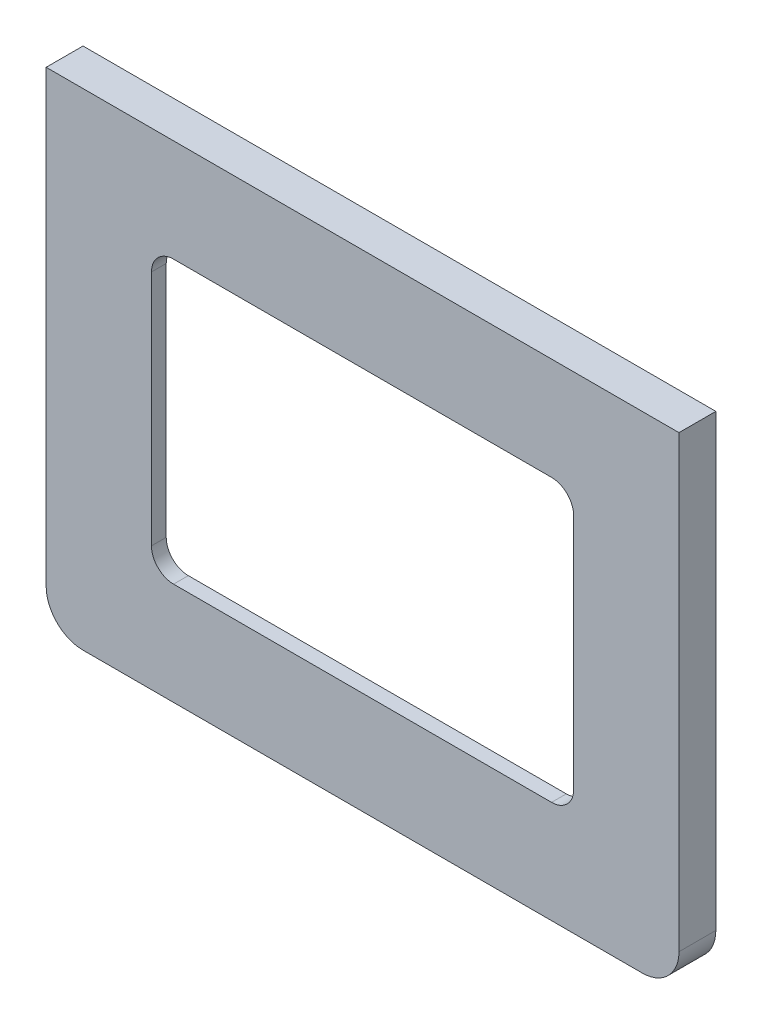
ISO-10303-21;
HEADER;
FILE_DESCRIPTION(('STEP AP214'),'2;1');
FILE_NAME('part.step','',(''),(''),'','','');
FILE_SCHEMA(('AUTOMOTIVE_DESIGN { 1 0 10303 214 1 1 1 1 }'));
ENDSEC;
DATA;
#1=APPLICATION_CONTEXT('core data for automotive mechanical design processes');
#2=APPLICATION_PROTOCOL_DEFINITION('international standard','automotive_design',2000,#1);
#3=PRODUCT_CONTEXT('',#1,'mechanical');
#4=PRODUCT('Part','Part','',(#3));
#5=PRODUCT_RELATED_PRODUCT_CATEGORY('part','',(#4));
#6=PRODUCT_DEFINITION_FORMATION('','',#4);
#7=PRODUCT_DEFINITION_CONTEXT('part definition',#1,'design');
#8=PRODUCT_DEFINITION('design','',#6,#7);
#9=PRODUCT_DEFINITION_SHAPE('','',#8);
#10=(LENGTH_UNIT() NAMED_UNIT(*) SI_UNIT(.MILLI.,.METRE.));
#11=(NAMED_UNIT(*) PLANE_ANGLE_UNIT() SI_UNIT($,.RADIAN.));
#12=(NAMED_UNIT(*) SI_UNIT($,.STERADIAN.) SOLID_ANGLE_UNIT());
#13=UNCERTAINTY_MEASURE_WITH_UNIT(LENGTH_MEASURE(1.E-05),#10,'distance_accuracy_value','');
#14=(GEOMETRIC_REPRESENTATION_CONTEXT(3) GLOBAL_UNCERTAINTY_ASSIGNED_CONTEXT((#13)) GLOBAL_UNIT_ASSIGNED_CONTEXT((#10,
#11,#12)) REPRESENTATION_CONTEXT('',''));
#15=CARTESIAN_POINT('',(0.,0.,0.));
#16=DIRECTION('',(0.,0.,1.));
#17=DIRECTION('',(1.,0.,0.));
#18=AXIS2_PLACEMENT_3D('',#15,#16,#17);
#19=CARTESIAN_POINT('',(77.87,2.,3.));
#20=DIRECTION('',(0.,0.,-1.));
#21=DIRECTION('',(-1.,0.,0.));
#22=AXIS2_PLACEMENT_3D('',#19,#20,#21);
#23=PLANE('',#22);
#24=CARTESIAN_POINT('',(70.3,56.,3.));
#25=DIRECTION('',(0.,0.,-1.));
#26=DIRECTION('',(-1.,0.,0.));
#27=AXIS2_PLACEMENT_3D('',#24,#25,#26);
#28=CIRCLE('',#27,1.5);
#29=CARTESIAN_POINT('',(68.8,56.,3.));
#30=VERTEX_POINT('',#29);
#31=EDGE_CURVE('E363',#30,#30,#28,.T.);
#32=ORIENTED_EDGE('',*,*,#31,.F.);
#33=EDGE_LOOP('',(#32));
#34=FACE_BOUND('',#33,.T.);
#35=CARTESIAN_POINT('',(3.99999999999999,3.99999999999998,3.));
#36=DIRECTION('',(0.,0.,-1.));
#37=DIRECTION('',(-1.,0.,0.));
#38=AXIS2_PLACEMENT_3D('',#35,#36,#37);
#39=CIRCLE('',#38,1.5);
#40=CARTESIAN_POINT('',(2.49999999999999,3.99999999999998,3.));
#41=VERTEX_POINT('',#40);
#42=EDGE_CURVE('E349',#41,#41,#39,.T.);
#43=ORIENTED_EDGE('',*,*,#42,.F.);
#44=EDGE_LOOP('',(#43));
#45=FACE_BOUND('',#44,.T.);
#46=DIRECTION('',(-1.,0.,0.));
#47=VECTOR('',#46,1.);
#48=CARTESIAN_POINT('',(11.29,49.095,3.));
#49=LINE('',#48,#47);
#50=CARTESIAN_POINT('',(65.58,49.095,3.));
#51=VERTEX_POINT('',#50);
#52=CARTESIAN_POINT('',(14.29,49.095,3.));
#53=VERTEX_POINT('',#52);
#54=EDGE_CURVE('E324',#51,#53,#49,.T.);
#55=ORIENTED_EDGE('',*,*,#54,.T.);
#56=CARTESIAN_POINT('',(14.29,46.095,3.));
#57=DIRECTION('',(0.,0.,-1.));
#58=DIRECTION('',(-1.,0.,0.));
#59=AXIS2_PLACEMENT_3D('',#56,#57,#58);
#60=CIRCLE('',#59,3.);
#61=CARTESIAN_POINT('',(11.29,46.095,3.));
#62=VERTEX_POINT('',#61);
#63=EDGE_CURVE('E11',#53,#62,#60,.F.);
#64=ORIENTED_EDGE('',*,*,#63,.T.);
#65=DIRECTION('',(0.,-1.,0.));
#66=VECTOR('',#65,1.);
#67=CARTESIAN_POINT('',(11.29,49.095,3.));
#68=LINE('',#67,#66);
#69=CARTESIAN_POINT('',(11.29,13.905,3.));
#70=VERTEX_POINT('',#69);
#71=EDGE_CURVE('E322',#62,#70,#68,.T.);
#72=ORIENTED_EDGE('',*,*,#71,.T.);
#73=CARTESIAN_POINT('',(14.29,13.905,3.));
#74=DIRECTION('',(0.,0.,-1.));
#75=DIRECTION('',(-1.,0.,0.));
#76=AXIS2_PLACEMENT_3D('',#73,#74,#75);
#77=CIRCLE('',#76,3.);
#78=CARTESIAN_POINT('',(14.29,10.905,3.));
#79=VERTEX_POINT('',#78);
#80=EDGE_CURVE('E304',#70,#79,#77,.F.);
#81=ORIENTED_EDGE('',*,*,#80,.T.);
#82=DIRECTION('',(1.,0.,0.));
#83=VECTOR('',#82,1.);
#84=CARTESIAN_POINT('',(11.29,10.905,3.));
#85=LINE('',#84,#83);
#86=CARTESIAN_POINT('',(65.58,10.905,3.));
#87=VERTEX_POINT('',#86);
#88=EDGE_CURVE('E201',#79,#87,#85,.T.);
#89=ORIENTED_EDGE('',*,*,#88,.T.);
#90=CARTESIAN_POINT('',(65.58,13.905,3.));
#91=DIRECTION('',(0.,0.,-1.));
#92=DIRECTION('',(-1.,0.,0.));
#93=AXIS2_PLACEMENT_3D('',#90,#91,#92);
#94=CIRCLE('',#93,3.);
#95=CARTESIAN_POINT('',(68.58,13.905,3.));
#96=VERTEX_POINT('',#95);
#97=EDGE_CURVE('E300',#87,#96,#94,.F.);
#98=ORIENTED_EDGE('',*,*,#97,.T.);
#99=DIRECTION('',(0.,1.,0.));
#100=VECTOR('',#99,1.);
#101=CARTESIAN_POINT('',(68.58,49.095,3.));
#102=LINE('',#101,#100);
#103=CARTESIAN_POINT('',(68.58,46.095,3.));
#104=VERTEX_POINT('',#103);
#105=EDGE_CURVE('E328',#96,#104,#102,.T.);
#106=ORIENTED_EDGE('',*,*,#105,.T.);
#107=CARTESIAN_POINT('',(65.58,46.095,3.));
#108=DIRECTION('',(0.,0.,-1.));
#109=DIRECTION('',(-1.,0.,0.));
#110=AXIS2_PLACEMENT_3D('',#107,#108,#109);
#111=CIRCLE('',#110,3.);
#112=EDGE_CURVE('E296',#104,#51,#111,.F.);
#113=ORIENTED_EDGE('',*,*,#112,.T.);
#114=EDGE_LOOP('',(#55,#64,#72,#81,#89,#98,#106,#113));
#115=FACE_BOUND('',#114,.T.);
#116=DIRECTION('',(1.,0.,0.));
#117=VECTOR('',#116,1.);
#118=CARTESIAN_POINT('',(-1.,61.,3.));
#119=LINE('',#118,#117);
#120=CARTESIAN_POINT('',(-1.,61.,3.));
#121=VERTEX_POINT('',#120);
#122=CARTESIAN_POINT('',(80.87,61.,3.));
#123=VERTEX_POINT('',#122);
#124=EDGE_CURVE('E174',#121,#123,#119,.T.);
#125=ORIENTED_EDGE('',*,*,#124,.T.);
#126=DIRECTION('',(0.,-1.,0.));
#127=VECTOR('',#126,1.);
#128=CARTESIAN_POINT('',(80.87,61.,3.));
#129=LINE('',#128,#127);
#130=CARTESIAN_POINT('',(80.87,2.,3.));
#131=VERTEX_POINT('',#130);
#132=EDGE_CURVE('E185',#123,#131,#129,.T.);
#133=ORIENTED_EDGE('',*,*,#132,.T.);
#134=CARTESIAN_POINT('',(77.87,2.,3.));
#135=DIRECTION('',(0.,0.,-1.));
#136=DIRECTION('',(-1.,0.,0.));
#137=AXIS2_PLACEMENT_3D('',#134,#135,#136);
#138=CIRCLE('',#137,3.);
#139=CARTESIAN_POINT('',(77.87,-1.,3.));
#140=VERTEX_POINT('',#139);
#141=EDGE_CURVE('E190',#131,#140,#138,.T.);
#142=ORIENTED_EDGE('',*,*,#141,.T.);
#143=DIRECTION('',(-1.,0.,0.));
#144=VECTOR('',#143,1.);
#145=CARTESIAN_POINT('',(77.87,-1.,3.));
#146=LINE('',#145,#144);
#147=CARTESIAN_POINT('',(2.,-1.,3.));
#148=VERTEX_POINT('',#147);
#149=EDGE_CURVE('E205',#140,#148,#146,.T.);
#150=ORIENTED_EDGE('',*,*,#149,.T.);
#151=CARTESIAN_POINT('',(2.,2.,3.));
#152=DIRECTION('',(0.,0.,-1.));
#153=DIRECTION('',(-1.,0.,0.));
#154=AXIS2_PLACEMENT_3D('',#151,#152,#153);
#155=CIRCLE('',#154,3.);
#156=CARTESIAN_POINT('',(-1.,2.,3.));
#157=VERTEX_POINT('',#156);
#158=EDGE_CURVE('E208',#148,#157,#155,.T.);
#159=ORIENTED_EDGE('',*,*,#158,.T.);
#160=DIRECTION('',(0.,1.,0.));
#161=VECTOR('',#160,1.);
#162=CARTESIAN_POINT('',(-1.,2.,3.));
#163=LINE('',#162,#161);
#164=EDGE_CURVE('E182',#157,#121,#163,.T.);
#165=ORIENTED_EDGE('',*,*,#164,.T.);
#166=EDGE_LOOP('',(#125,#133,#142,#150,#159,#165));
#167=FACE_BOUND('',#166,.T.);
#168=CARTESIAN_POINT('',(3.99999999999999,56.,3.));
#169=DIRECTION('',(0.,0.,-1.));
#170=DIRECTION('',(-1.,0.,0.));
#171=AXIS2_PLACEMENT_3D('',#168,#169,#170);
#172=CIRCLE('',#171,1.5);
#173=CARTESIAN_POINT('',(2.49999999999999,56.,3.));
#174=VERTEX_POINT('',#173);
#175=EDGE_CURVE('E357',#174,#174,#172,.T.);
#176=ORIENTED_EDGE('',*,*,#175,.F.);
#177=EDGE_LOOP('',(#176));
#178=FACE_BOUND('',#177,.T.);
#179=CARTESIAN_POINT('',(70.3,3.99999999999998,3.));
#180=DIRECTION('',(0.,0.,-1.));
#181=DIRECTION('',(-1.,0.,0.));
#182=AXIS2_PLACEMENT_3D('',#179,#180,#181);
#183=CIRCLE('',#182,1.5);
#184=CARTESIAN_POINT('',(68.8,3.99999999999998,3.));
#185=VERTEX_POINT('',#184);
#186=EDGE_CURVE('E369',#185,#185,#183,.T.);
#187=ORIENTED_EDGE('',*,*,#186,.F.);
#188=EDGE_LOOP('',(#187));
#189=FACE_BOUND('',#188,.T.);
#190=ADVANCED_FACE('F33',(#34,#45,#115,#167,#178,#189),#23,.T.);
#191=CARTESIAN_POINT('',(-3.,0.,5.));
#192=DIRECTION('',(-1.,0.,0.));
#193=DIRECTION('',(0.,0.,1.));
#194=AXIS2_PLACEMENT_3D('',#191,#192,#193);
#195=PLANE('',#194);
#196=DIRECTION('',(0.,1.,0.));
#197=VECTOR('',#196,1.);
#198=CARTESIAN_POINT('',(-3.,0.,0.));
#199=LINE('',#198,#197);
#200=CARTESIAN_POINT('',(-3.,2.,0.));
#201=VERTEX_POINT('',#200);
#202=CARTESIAN_POINT('',(-3.,63.,0.));
#203=VERTEX_POINT('',#202);
#204=EDGE_CURVE('E224',#201,#203,#199,.T.);
#205=ORIENTED_EDGE('',*,*,#204,.F.);
#206=DIRECTION('',(0.,0.,-1.));
#207=VECTOR('',#206,1.);
#208=CARTESIAN_POINT('',(-3.,2.,5.));
#209=LINE('',#208,#207);
#210=CARTESIAN_POINT('',(-3.,2.,5.));
#211=VERTEX_POINT('',#210);
#212=EDGE_CURVE('E273',#201,#211,#209,.F.);
#213=ORIENTED_EDGE('',*,*,#212,.T.);
#214=DIRECTION('',(0.,1.,0.));
#215=VECTOR('',#214,1.);
#216=CARTESIAN_POINT('',(-3.,0.,5.));
#217=LINE('',#216,#215);
#218=CARTESIAN_POINT('',(-3.,63.,5.));
#219=VERTEX_POINT('',#218);
#220=EDGE_CURVE('E232',#211,#219,#217,.T.);
#221=ORIENTED_EDGE('',*,*,#220,.T.);
#222=DIRECTION('',(0.,0.,-1.));
#223=VECTOR('',#222,1.);
#224=CARTESIAN_POINT('',(-3.,63.,5.));
#225=LINE('',#224,#223);
#226=EDGE_CURVE('E243',#219,#203,#225,.T.);
#227=ORIENTED_EDGE('',*,*,#226,.T.);
#228=EDGE_LOOP('',(#205,#213,#221,#227));
#229=FACE_BOUND('',#228,.T.);
#230=ADVANCED_FACE('F376',(#229),#195,.T.);
#231=CARTESIAN_POINT('',(0.,-3.,5.));
#232=DIRECTION('',(0.,1.,0.));
#233=DIRECTION('',(0.,0.,1.));
#234=AXIS2_PLACEMENT_3D('',#231,#232,#233);
#235=PLANE('',#234);
#236=DIRECTION('',(1.,0.,0.));
#237=VECTOR('',#236,1.);
#238=CARTESIAN_POINT('',(0.,-3.,0.));
#239=LINE('',#238,#237);
#240=CARTESIAN_POINT('',(2.,-3.,0.));
#241=VERTEX_POINT('',#240);
#242=CARTESIAN_POINT('',(77.87,-3.,0.));
#243=VERTEX_POINT('',#242);
#244=EDGE_CURVE('E245',#241,#243,#239,.T.);
#245=ORIENTED_EDGE('',*,*,#244,.T.);
#246=DIRECTION('',(0.,0.,-1.));
#247=VECTOR('',#246,1.);
#248=CARTESIAN_POINT('',(77.87,-3.,5.));
#249=LINE('',#248,#247);
#250=CARTESIAN_POINT('',(77.87,-3.,5.));
#251=VERTEX_POINT('',#250);
#252=EDGE_CURVE('E267',#243,#251,#249,.F.);
#253=ORIENTED_EDGE('',*,*,#252,.T.);
#254=DIRECTION('',(1.,0.,0.));
#255=VECTOR('',#254,1.);
#256=CARTESIAN_POINT('',(0.,-3.,5.));
#257=LINE('',#256,#255);
#258=CARTESIAN_POINT('',(2.,-3.,5.));
#259=VERTEX_POINT('',#258);
#260=EDGE_CURVE('E234',#259,#251,#257,.T.);
#261=ORIENTED_EDGE('',*,*,#260,.F.);
#262=DIRECTION('',(0.,0.,-1.));
#263=VECTOR('',#262,1.);
#264=CARTESIAN_POINT('',(2.,-3.,0.));
#265=LINE('',#264,#263);
#266=EDGE_CURVE('E264',#259,#241,#265,.T.);
#267=ORIENTED_EDGE('',*,*,#266,.T.);
#268=EDGE_LOOP('',(#245,#253,#261,#267));
#269=FACE_BOUND('',#268,.T.);
#270=ADVANCED_FACE('F382',(#269),#235,.F.);
#271=CARTESIAN_POINT('',(82.87,0.,5.));
#272=DIRECTION('',(-1.,0.,0.));
#273=DIRECTION('',(0.,0.,1.));
#274=AXIS2_PLACEMENT_3D('',#271,#272,#273);
#275=PLANE('',#274);
#276=DIRECTION('',(0.,1.,0.));
#277=VECTOR('',#276,1.);
#278=CARTESIAN_POINT('',(82.87,0.,5.));
#279=LINE('',#278,#277);
#280=CARTESIAN_POINT('',(82.87,2.,5.));
#281=VERTEX_POINT('',#280);
#282=CARTESIAN_POINT('',(82.87,63.,5.));
#283=VERTEX_POINT('',#282);
#284=EDGE_CURVE('E238',#281,#283,#279,.T.);
#285=ORIENTED_EDGE('',*,*,#284,.F.);
#286=DIRECTION('',(0.,0.,-1.));
#287=VECTOR('',#286,1.);
#288=CARTESIAN_POINT('',(82.87,2.,5.));
#289=LINE('',#288,#287);
#290=CARTESIAN_POINT('',(82.87,2.,0.));
#291=VERTEX_POINT('',#290);
#292=EDGE_CURVE('E257',#281,#291,#289,.T.);
#293=ORIENTED_EDGE('',*,*,#292,.T.);
#294=DIRECTION('',(0.,1.,0.));
#295=VECTOR('',#294,1.);
#296=CARTESIAN_POINT('',(82.87,0.,0.));
#297=LINE('',#296,#295);
#298=CARTESIAN_POINT('',(82.87,63.,0.));
#299=VERTEX_POINT('',#298);
#300=EDGE_CURVE('E248',#291,#299,#297,.T.);
#301=ORIENTED_EDGE('',*,*,#300,.T.);
#302=DIRECTION('',(0.,0.,-1.));
#303=VECTOR('',#302,1.);
#304=CARTESIAN_POINT('',(82.87,63.,5.));
#305=LINE('',#304,#303);
#306=EDGE_CURVE('E254',#283,#299,#305,.T.);
#307=ORIENTED_EDGE('',*,*,#306,.F.);
#308=EDGE_LOOP('',(#285,#293,#301,#307));
#309=FACE_BOUND('',#308,.T.);
#310=ADVANCED_FACE('F421',(#309),#275,.F.);
#311=CARTESIAN_POINT('',(0.,63.,5.));
#312=DIRECTION('',(0.,1.,0.));
#313=DIRECTION('',(0.,0.,1.));
#314=AXIS2_PLACEMENT_3D('',#311,#312,#313);
#315=PLANE('',#314);
#316=DIRECTION('',(1.,0.,0.));
#317=VECTOR('',#316,1.);
#318=CARTESIAN_POINT('',(0.,63.,0.));
#319=LINE('',#318,#317);
#320=EDGE_CURVE('E235',#203,#299,#319,.T.);
#321=ORIENTED_EDGE('',*,*,#320,.F.);
#322=ORIENTED_EDGE('',*,*,#226,.F.);
#323=DIRECTION('',(1.,0.,0.));
#324=VECTOR('',#323,1.);
#325=CARTESIAN_POINT('',(0.,63.,5.));
#326=LINE('',#325,#324);
#327=EDGE_CURVE('E240',#219,#283,#326,.T.);
#328=ORIENTED_EDGE('',*,*,#327,.T.);
#329=ORIENTED_EDGE('',*,*,#306,.T.);
#330=EDGE_LOOP('',(#321,#322,#328,#329));
#331=FACE_BOUND('',#330,.T.);
#332=ADVANCED_FACE('F414',(#331),#315,.T.);
#333=CARTESIAN_POINT('',(0.,0.,5.));
#334=DIRECTION('',(0.,0.,1.));
#335=DIRECTION('',(1.,0.,0.));
#336=AXIS2_PLACEMENT_3D('',#333,#334,#335);
#337=PLANE('',#336);
#338=DIRECTION('',(0.,-1.,0.));
#339=VECTOR('',#338,1.);
#340=CARTESIAN_POINT('',(11.29,49.095,5.));
#341=LINE('',#340,#339);
#342=CARTESIAN_POINT('',(11.29,46.095,5.));
#343=VERTEX_POINT('',#342);
#344=CARTESIAN_POINT('',(11.29,13.905,5.));
#345=VERTEX_POINT('',#344);
#346=EDGE_CURVE('E312',#343,#345,#341,.T.);
#347=ORIENTED_EDGE('',*,*,#346,.F.);
#348=CARTESIAN_POINT('',(14.29,46.095,5.));
#349=DIRECTION('',(0.,0.,1.));
#350=DIRECTION('',(1.,0.,0.));
#351=AXIS2_PLACEMENT_3D('',#348,#349,#350);
#352=CIRCLE('',#351,3.);
#353=CARTESIAN_POINT('',(14.29,49.095,5.));
#354=VERTEX_POINT('',#353);
#355=EDGE_CURVE('E41',#343,#354,#352,.F.);
#356=ORIENTED_EDGE('',*,*,#355,.T.);
#357=DIRECTION('',(-1.,0.,0.));
#358=VECTOR('',#357,1.);
#359=CARTESIAN_POINT('',(11.29,49.095,5.));
#360=LINE('',#359,#358);
#361=CARTESIAN_POINT('',(65.58,49.095,5.));
#362=VERTEX_POINT('',#361);
#363=EDGE_CURVE('E311',#362,#354,#360,.T.);
#364=ORIENTED_EDGE('',*,*,#363,.F.);
#365=CARTESIAN_POINT('',(65.58,46.095,5.));
#366=DIRECTION('',(0.,0.,1.));
#367=DIRECTION('',(1.,0.,0.));
#368=AXIS2_PLACEMENT_3D('',#365,#366,#367);
#369=CIRCLE('',#368,3.);
#370=CARTESIAN_POINT('',(68.58,46.095,5.));
#371=VERTEX_POINT('',#370);
#372=EDGE_CURVE('E294',#362,#371,#369,.F.);
#373=ORIENTED_EDGE('',*,*,#372,.T.);
#374=DIRECTION('',(0.,1.,0.));
#375=VECTOR('',#374,1.);
#376=CARTESIAN_POINT('',(68.58,49.095,5.));
#377=LINE('',#376,#375);
#378=CARTESIAN_POINT('',(68.58,13.905,5.));
#379=VERTEX_POINT('',#378);
#380=EDGE_CURVE('E320',#379,#371,#377,.T.);
#381=ORIENTED_EDGE('',*,*,#380,.F.);
#382=CARTESIAN_POINT('',(65.58,13.905,5.));
#383=DIRECTION('',(0.,0.,1.));
#384=DIRECTION('',(1.,0.,0.));
#385=AXIS2_PLACEMENT_3D('',#382,#383,#384);
#386=CIRCLE('',#385,3.);
#387=CARTESIAN_POINT('',(65.58,10.905,5.));
#388=VERTEX_POINT('',#387);
#389=EDGE_CURVE('E298',#379,#388,#386,.F.);
#390=ORIENTED_EDGE('',*,*,#389,.T.);
#391=DIRECTION('',(1.,0.,0.));
#392=VECTOR('',#391,1.);
#393=CARTESIAN_POINT('',(11.29,10.905,5.));
#394=LINE('',#393,#392);
#395=CARTESIAN_POINT('',(14.29,10.905,5.));
#396=VERTEX_POINT('',#395);
#397=EDGE_CURVE('E326',#396,#388,#394,.T.);
#398=ORIENTED_EDGE('',*,*,#397,.F.);
#399=CARTESIAN_POINT('',(14.29,13.905,5.));
#400=DIRECTION('',(0.,0.,1.));
#401=DIRECTION('',(1.,0.,0.));
#402=AXIS2_PLACEMENT_3D('',#399,#400,#401);
#403=CIRCLE('',#402,3.);
#404=EDGE_CURVE('E302',#396,#345,#403,.F.);
#405=ORIENTED_EDGE('',*,*,#404,.T.);
#406=EDGE_LOOP('',(#347,#356,#364,#373,#381,#390,#398,#405));
#407=FACE_BOUND('',#406,.T.);
#408=ORIENTED_EDGE('',*,*,#260,.T.);
#409=CARTESIAN_POINT('',(77.87,2.,5.));
#410=DIRECTION('',(0.,0.,1.));
#411=DIRECTION('',(1.,0.,0.));
#412=AXIS2_PLACEMENT_3D('',#409,#410,#411);
#413=CIRCLE('',#412,5.);
#414=EDGE_CURVE('E271',#251,#281,#413,.T.);
#415=ORIENTED_EDGE('',*,*,#414,.T.);
#416=ORIENTED_EDGE('',*,*,#284,.T.);
#417=ORIENTED_EDGE('',*,*,#327,.F.);
#418=ORIENTED_EDGE('',*,*,#220,.F.);
#419=CARTESIAN_POINT('',(2.,2.,5.));
#420=DIRECTION('',(0.,0.,1.));
#421=DIRECTION('',(1.,0.,0.));
#422=AXIS2_PLACEMENT_3D('',#419,#420,#421);
#423=CIRCLE('',#422,5.);
#424=EDGE_CURVE('E269',#211,#259,#423,.T.);
#425=ORIENTED_EDGE('',*,*,#424,.T.);
#426=EDGE_LOOP('',(#408,#415,#416,#417,#418,#425));
#427=FACE_BOUND('',#426,.T.);
#428=ADVANCED_FACE('F309',(#407,#427),#337,.T.);
#429=CARTESIAN_POINT('',(0.,0.,0.));
#430=DIRECTION('',(0.,0.,1.));
#431=DIRECTION('',(1.,0.,0.));
#432=AXIS2_PLACEMENT_3D('',#429,#430,#431);
#433=PLANE('',#432);
#434=DIRECTION('',(0.,-1.,0.));
#435=VECTOR('',#434,1.);
#436=CARTESIAN_POINT('',(80.87,61.,0.));
#437=LINE('',#436,#435);
#438=CARTESIAN_POINT('',(80.87,61.,0.));
#439=VERTEX_POINT('',#438);
#440=CARTESIAN_POINT('',(80.87,2.,0.));
#441=VERTEX_POINT('',#440);
#442=EDGE_CURVE('E212',#439,#441,#437,.T.);
#443=ORIENTED_EDGE('',*,*,#442,.F.);
#444=DIRECTION('',(1.,0.,0.));
#445=VECTOR('',#444,1.);
#446=CARTESIAN_POINT('',(-1.,61.,0.));
#447=LINE('',#446,#445);
#448=CARTESIAN_POINT('',(-1.,61.,0.));
#449=VERTEX_POINT('',#448);
#450=EDGE_CURVE('E177',#449,#439,#447,.T.);
#451=ORIENTED_EDGE('',*,*,#450,.F.);
#452=DIRECTION('',(0.,1.,0.));
#453=VECTOR('',#452,1.);
#454=CARTESIAN_POINT('',(-1.,2.,0.));
#455=LINE('',#454,#453);
#456=CARTESIAN_POINT('',(-1.,2.,0.));
#457=VERTEX_POINT('',#456);
#458=EDGE_CURVE('E195',#457,#449,#455,.T.);
#459=ORIENTED_EDGE('',*,*,#458,.F.);
#460=CARTESIAN_POINT('',(2.,2.,0.));
#461=DIRECTION('',(0.,0.,-1.));
#462=DIRECTION('',(-1.,0.,0.));
#463=AXIS2_PLACEMENT_3D('',#460,#461,#462);
#464=CIRCLE('',#463,3.);
#465=CARTESIAN_POINT('',(2.,-1.,0.));
#466=VERTEX_POINT('',#465);
#467=EDGE_CURVE('E198',#466,#457,#464,.T.);
#468=ORIENTED_EDGE('',*,*,#467,.F.);
#469=DIRECTION('',(-1.,0.,0.));
#470=VECTOR('',#469,1.);
#471=CARTESIAN_POINT('',(77.87,-1.,0.));
#472=LINE('',#471,#470);
#473=CARTESIAN_POINT('',(77.87,-1.,0.));
#474=VERTEX_POINT('',#473);
#475=EDGE_CURVE('E217',#474,#466,#472,.T.);
#476=ORIENTED_EDGE('',*,*,#475,.F.);
#477=CARTESIAN_POINT('',(77.87,2.,0.));
#478=DIRECTION('',(0.,0.,-1.));
#479=DIRECTION('',(-1.,0.,0.));
#480=AXIS2_PLACEMENT_3D('',#477,#478,#479);
#481=CIRCLE('',#480,3.);
#482=EDGE_CURVE('E214',#441,#474,#481,.T.);
#483=ORIENTED_EDGE('',*,*,#482,.F.);
#484=EDGE_LOOP('',(#443,#451,#459,#468,#476,#483));
#485=FACE_BOUND('',#484,.T.);
#486=ORIENTED_EDGE('',*,*,#300,.F.);
#487=CARTESIAN_POINT('',(77.87,2.,0.));
#488=DIRECTION('',(0.,0.,1.));
#489=DIRECTION('',(1.,0.,0.));
#490=AXIS2_PLACEMENT_3D('',#487,#488,#489);
#491=CIRCLE('',#490,5.);
#492=EDGE_CURVE('E262',#291,#243,#491,.F.);
#493=ORIENTED_EDGE('',*,*,#492,.T.);
#494=ORIENTED_EDGE('',*,*,#244,.F.);
#495=CARTESIAN_POINT('',(2.,2.,0.));
#496=DIRECTION('',(0.,0.,1.));
#497=DIRECTION('',(1.,0.,0.));
#498=AXIS2_PLACEMENT_3D('',#495,#496,#497);
#499=CIRCLE('',#498,5.);
#500=EDGE_CURVE('E260',#241,#201,#499,.F.);
#501=ORIENTED_EDGE('',*,*,#500,.T.);
#502=ORIENTED_EDGE('',*,*,#204,.T.);
#503=ORIENTED_EDGE('',*,*,#320,.T.);
#504=EDGE_LOOP('',(#486,#493,#494,#501,#502,#503));
#505=FACE_BOUND('',#504,.T.);
#506=ADVANCED_FACE('F413',(#485,#505),#433,.F.);
#507=CARTESIAN_POINT('',(77.87,2.,5.));
#508=DIRECTION('',(0.,0.,-1.));
#509=DIRECTION('',(-1.,0.,0.));
#510=AXIS2_PLACEMENT_3D('',#507,#508,#509);
#511=CYLINDRICAL_SURFACE('',#510,5.);
#512=ORIENTED_EDGE('',*,*,#414,.F.);
#513=ORIENTED_EDGE('',*,*,#252,.F.);
#514=ORIENTED_EDGE('',*,*,#492,.F.);
#515=ORIENTED_EDGE('',*,*,#292,.F.);
#516=EDGE_LOOP('',(#512,#513,#514,#515));
#517=FACE_BOUND('',#516,.T.);
#518=ADVANCED_FACE('F417',(#517),#511,.T.);
#519=CARTESIAN_POINT('',(2.,2.,5.));
#520=DIRECTION('',(0.,0.,1.));
#521=DIRECTION('',(1.,0.,0.));
#522=AXIS2_PLACEMENT_3D('',#519,#520,#521);
#523=CYLINDRICAL_SURFACE('',#522,5.);
#524=ORIENTED_EDGE('',*,*,#424,.F.);
#525=ORIENTED_EDGE('',*,*,#212,.F.);
#526=ORIENTED_EDGE('',*,*,#500,.F.);
#527=ORIENTED_EDGE('',*,*,#266,.F.);
#528=EDGE_LOOP('',(#524,#525,#526,#527));
#529=FACE_BOUND('',#528,.T.);
#530=ADVANCED_FACE('F410',(#529),#523,.T.);
#531=CARTESIAN_POINT('',(-1.,61.,3.));
#532=DIRECTION('',(0.,1.,0.));
#533=DIRECTION('',(0.,0.,1.));
#534=AXIS2_PLACEMENT_3D('',#531,#532,#533);
#535=PLANE('',#534);
#536=ORIENTED_EDGE('',*,*,#450,.T.);
#537=DIRECTION('',(0.,0.,-1.));
#538=VECTOR('',#537,1.);
#539=CARTESIAN_POINT('',(80.87,61.,3.));
#540=LINE('',#539,#538);
#541=EDGE_CURVE('E170',#123,#439,#540,.T.);
#542=ORIENTED_EDGE('',*,*,#541,.F.);
#543=ORIENTED_EDGE('',*,*,#124,.F.);
#544=DIRECTION('',(0.,0.,-1.));
#545=VECTOR('',#544,1.);
#546=CARTESIAN_POINT('',(-1.,61.,3.));
#547=LINE('',#546,#545);
#548=EDGE_CURVE('E222',#121,#449,#547,.T.);
#549=ORIENTED_EDGE('',*,*,#548,.T.);
#550=EDGE_LOOP('',(#536,#542,#543,#549));
#551=FACE_BOUND('',#550,.T.);
#552=ADVANCED_FACE('F172',(#551),#535,.F.);
#553=CARTESIAN_POINT('',(-1.,2.,3.));
#554=DIRECTION('',(-1.,0.,0.));
#555=DIRECTION('',(0.,0.,1.));
#556=AXIS2_PLACEMENT_3D('',#553,#554,#555);
#557=PLANE('',#556);
#558=ORIENTED_EDGE('',*,*,#458,.T.);
#559=ORIENTED_EDGE('',*,*,#548,.F.);
#560=ORIENTED_EDGE('',*,*,#164,.F.);
#561=DIRECTION('',(0.,0.,-1.));
#562=VECTOR('',#561,1.);
#563=CARTESIAN_POINT('',(-1.,2.,3.));
#564=LINE('',#563,#562);
#565=EDGE_CURVE('E225',#157,#457,#564,.T.);
#566=ORIENTED_EDGE('',*,*,#565,.T.);
#567=EDGE_LOOP('',(#558,#559,#560,#566));
#568=FACE_BOUND('',#567,.T.);
#569=ADVANCED_FACE('F390',(#568),#557,.F.);
#570=CARTESIAN_POINT('',(2.,2.,3.));
#571=DIRECTION('',(0.,0.,-1.));
#572=DIRECTION('',(-1.,0.,0.));
#573=AXIS2_PLACEMENT_3D('',#570,#571,#572);
#574=CYLINDRICAL_SURFACE('',#573,3.);
#575=ORIENTED_EDGE('',*,*,#467,.T.);
#576=ORIENTED_EDGE('',*,*,#565,.F.);
#577=ORIENTED_EDGE('',*,*,#158,.F.);
#578=DIRECTION('',(0.,0.,-1.));
#579=VECTOR('',#578,1.);
#580=CARTESIAN_POINT('',(2.,-1.,3.));
#581=LINE('',#580,#579);
#582=EDGE_CURVE('E227',#148,#466,#581,.T.);
#583=ORIENTED_EDGE('',*,*,#582,.T.);
#584=EDGE_LOOP('',(#575,#576,#577,#583));
#585=FACE_BOUND('',#584,.T.);
#586=ADVANCED_FACE('F393',(#585),#574,.F.);
#587=CARTESIAN_POINT('',(77.87,-1.,3.));
#588=DIRECTION('',(0.,-1.,0.));
#589=DIRECTION('',(1.,0.,0.));
#590=AXIS2_PLACEMENT_3D('',#587,#588,#589);
#591=PLANE('',#590);
#592=ORIENTED_EDGE('',*,*,#475,.T.);
#593=ORIENTED_EDGE('',*,*,#582,.F.);
#594=ORIENTED_EDGE('',*,*,#149,.F.);
#595=DIRECTION('',(0.,0.,-1.));
#596=VECTOR('',#595,1.);
#597=CARTESIAN_POINT('',(77.87,-1.,3.));
#598=LINE('',#597,#596);
#599=EDGE_CURVE('E229',#140,#474,#598,.T.);
#600=ORIENTED_EDGE('',*,*,#599,.T.);
#601=EDGE_LOOP('',(#592,#593,#594,#600));
#602=FACE_BOUND('',#601,.T.);
#603=ADVANCED_FACE('F397',(#602),#591,.F.);
#604=CARTESIAN_POINT('',(77.87,2.,3.));
#605=DIRECTION('',(0.,0.,-1.));
#606=DIRECTION('',(-1.,0.,0.));
#607=AXIS2_PLACEMENT_3D('',#604,#605,#606);
#608=CYLINDRICAL_SURFACE('',#607,3.);
#609=ORIENTED_EDGE('',*,*,#482,.T.);
#610=ORIENTED_EDGE('',*,*,#599,.F.);
#611=ORIENTED_EDGE('',*,*,#141,.F.);
#612=DIRECTION('',(0.,0.,-1.));
#613=VECTOR('',#612,1.);
#614=CARTESIAN_POINT('',(80.87,2.,3.));
#615=LINE('',#614,#613);
#616=EDGE_CURVE('E181',#131,#441,#615,.T.);
#617=ORIENTED_EDGE('',*,*,#616,.T.);
#618=EDGE_LOOP('',(#609,#610,#611,#617));
#619=FACE_BOUND('',#618,.T.);
#620=ADVANCED_FACE('F401',(#619),#608,.F.);
#621=CARTESIAN_POINT('',(80.87,61.,3.));
#622=DIRECTION('',(1.,0.,0.));
#623=DIRECTION('',(0.,0.,-1.));
#624=AXIS2_PLACEMENT_3D('',#621,#622,#623);
#625=PLANE('',#624);
#626=ORIENTED_EDGE('',*,*,#442,.T.);
#627=ORIENTED_EDGE('',*,*,#616,.F.);
#628=ORIENTED_EDGE('',*,*,#132,.F.);
#629=ORIENTED_EDGE('',*,*,#541,.T.);
#630=EDGE_LOOP('',(#626,#627,#628,#629));
#631=FACE_BOUND('',#630,.T.);
#632=ADVANCED_FACE('F186',(#631),#625,.F.);
#633=CARTESIAN_POINT('',(11.29,49.095,-0.00100000000000013));
#634=DIRECTION('',(-1.,0.,0.));
#635=DIRECTION('',(0.,-1.,0.));
#636=AXIS2_PLACEMENT_3D('',#633,#634,#635);
#637=PLANE('',#636);
#638=ORIENTED_EDGE('',*,*,#346,.T.);
#639=DIRECTION('',(0.,0.,1.));
#640=VECTOR('',#639,1.);
#641=CARTESIAN_POINT('',(11.29,13.905,3.));
#642=LINE('',#641,#640);
#643=EDGE_CURVE('E48',#345,#70,#642,.F.);
#644=ORIENTED_EDGE('',*,*,#643,.T.);
#645=ORIENTED_EDGE('',*,*,#71,.F.);
#646=DIRECTION('',(0.,0.,1.));
#647=VECTOR('',#646,1.);
#648=CARTESIAN_POINT('',(11.29,46.095,5.));
#649=LINE('',#648,#647);
#650=EDGE_CURVE('E290',#62,#343,#649,.T.);
#651=ORIENTED_EDGE('',*,*,#650,.T.);
#652=EDGE_LOOP('',(#638,#644,#645,#651));
#653=FACE_BOUND('',#652,.T.);
#654=ADVANCED_FACE('F321',(#653),#637,.F.);
#655=CARTESIAN_POINT('',(11.29,49.095,-0.00100000000000013));
#656=DIRECTION('',(0.,1.,0.));
#657=DIRECTION('',(-1.,0.,0.));
#658=AXIS2_PLACEMENT_3D('',#655,#656,#657);
#659=PLANE('',#658);
#660=ORIENTED_EDGE('',*,*,#54,.F.);
#661=DIRECTION('',(0.,0.,1.));
#662=VECTOR('',#661,1.);
#663=CARTESIAN_POINT('',(65.58,49.095,5.));
#664=LINE('',#663,#662);
#665=EDGE_CURVE('E277',#51,#362,#664,.T.);
#666=ORIENTED_EDGE('',*,*,#665,.T.);
#667=ORIENTED_EDGE('',*,*,#363,.T.);
#668=DIRECTION('',(0.,0.,1.));
#669=VECTOR('',#668,1.);
#670=CARTESIAN_POINT('',(14.29,49.095,3.));
#671=LINE('',#670,#669);
#672=EDGE_CURVE('E275',#354,#53,#671,.F.);
#673=ORIENTED_EDGE('',*,*,#672,.T.);
#674=EDGE_LOOP('',(#660,#666,#667,#673));
#675=FACE_BOUND('',#674,.T.);
#676=ADVANCED_FACE('F318',(#675),#659,.F.);
#677=CARTESIAN_POINT('',(68.58,49.095,-0.00100000000000013));
#678=DIRECTION('',(1.,0.,0.));
#679=DIRECTION('',(0.,0.,-1.));
#680=AXIS2_PLACEMENT_3D('',#677,#678,#679);
#681=PLANE('',#680);
#682=ORIENTED_EDGE('',*,*,#380,.T.);
#683=DIRECTION('',(0.,0.,1.));
#684=VECTOR('',#683,1.);
#685=CARTESIAN_POINT('',(68.58,46.095,3.));
#686=LINE('',#685,#684);
#687=EDGE_CURVE('E283',#371,#104,#686,.F.);
#688=ORIENTED_EDGE('',*,*,#687,.T.);
#689=ORIENTED_EDGE('',*,*,#105,.F.);
#690=DIRECTION('',(0.,0.,1.));
#691=VECTOR('',#690,1.);
#692=CARTESIAN_POINT('',(68.58,13.905,5.));
#693=LINE('',#692,#691);
#694=EDGE_CURVE('E280',#96,#379,#693,.T.);
#695=ORIENTED_EDGE('',*,*,#694,.T.);
#696=EDGE_LOOP('',(#682,#688,#689,#695));
#697=FACE_BOUND('',#696,.T.);
#698=ADVANCED_FACE('F338',(#697),#681,.F.);
#699=CARTESIAN_POINT('',(11.29,10.905,-0.00100000000000013));
#700=DIRECTION('',(0.,-1.,0.));
#701=DIRECTION('',(1.,0.,0.));
#702=AXIS2_PLACEMENT_3D('',#699,#700,#701);
#703=PLANE('',#702);
#704=ORIENTED_EDGE('',*,*,#397,.T.);
#705=DIRECTION('',(0.,0.,1.));
#706=VECTOR('',#705,1.);
#707=CARTESIAN_POINT('',(65.58,10.905,3.));
#708=LINE('',#707,#706);
#709=EDGE_CURVE('E288',#388,#87,#708,.F.);
#710=ORIENTED_EDGE('',*,*,#709,.T.);
#711=ORIENTED_EDGE('',*,*,#88,.F.);
#712=DIRECTION('',(0.,0.,1.));
#713=VECTOR('',#712,1.);
#714=CARTESIAN_POINT('',(14.29,10.905,5.));
#715=LINE('',#714,#713);
#716=EDGE_CURVE('E285',#79,#396,#715,.T.);
#717=ORIENTED_EDGE('',*,*,#716,.T.);
#718=EDGE_LOOP('',(#704,#710,#711,#717));
#719=FACE_BOUND('',#718,.T.);
#720=ADVANCED_FACE('F438',(#719),#703,.F.);
#721=CARTESIAN_POINT('',(65.58,46.095,-0.00100000000000013));
#722=DIRECTION('',(0.,0.,-1.));
#723=DIRECTION('',(-1.,0.,0.));
#724=AXIS2_PLACEMENT_3D('',#721,#722,#723);
#725=CYLINDRICAL_SURFACE('',#724,3.);
#726=ORIENTED_EDGE('',*,*,#112,.F.);
#727=ORIENTED_EDGE('',*,*,#687,.F.);
#728=ORIENTED_EDGE('',*,*,#372,.F.);
#729=ORIENTED_EDGE('',*,*,#665,.F.);
#730=EDGE_LOOP('',(#726,#727,#728,#729));
#731=FACE_BOUND('',#730,.T.);
#732=ADVANCED_FACE('F344',(#731),#725,.F.);
#733=CARTESIAN_POINT('',(65.58,13.905,-0.00100000000000013));
#734=DIRECTION('',(0.,0.,-1.));
#735=DIRECTION('',(-1.,0.,0.));
#736=AXIS2_PLACEMENT_3D('',#733,#734,#735);
#737=CYLINDRICAL_SURFACE('',#736,3.);
#738=ORIENTED_EDGE('',*,*,#97,.F.);
#739=ORIENTED_EDGE('',*,*,#709,.F.);
#740=ORIENTED_EDGE('',*,*,#389,.F.);
#741=ORIENTED_EDGE('',*,*,#694,.F.);
#742=EDGE_LOOP('',(#738,#739,#740,#741));
#743=FACE_BOUND('',#742,.T.);
#744=ADVANCED_FACE('F437',(#743),#737,.F.);
#745=CARTESIAN_POINT('',(14.29,13.905,-0.00100000000000013));
#746=DIRECTION('',(0.,0.,-1.));
#747=DIRECTION('',(-1.,0.,0.));
#748=AXIS2_PLACEMENT_3D('',#745,#746,#747);
#749=CYLINDRICAL_SURFACE('',#748,3.);
#750=ORIENTED_EDGE('',*,*,#80,.F.);
#751=ORIENTED_EDGE('',*,*,#643,.F.);
#752=ORIENTED_EDGE('',*,*,#404,.F.);
#753=ORIENTED_EDGE('',*,*,#716,.F.);
#754=EDGE_LOOP('',(#750,#751,#752,#753));
#755=FACE_BOUND('',#754,.T.);
#756=ADVANCED_FACE('F440',(#755),#749,.F.);
#757=CARTESIAN_POINT('',(14.29,46.095,-0.00100000000000013));
#758=DIRECTION('',(0.,0.,-1.));
#759=DIRECTION('',(-1.,0.,0.));
#760=AXIS2_PLACEMENT_3D('',#757,#758,#759);
#761=CYLINDRICAL_SURFACE('',#760,3.);
#762=ORIENTED_EDGE('',*,*,#63,.F.);
#763=ORIENTED_EDGE('',*,*,#672,.F.);
#764=ORIENTED_EDGE('',*,*,#355,.F.);
#765=ORIENTED_EDGE('',*,*,#650,.F.);
#766=EDGE_LOOP('',(#762,#763,#764,#765));
#767=FACE_BOUND('',#766,.T.);
#768=ADVANCED_FACE('F35',(#767),#761,.F.);
#769=CARTESIAN_POINT('',(3.99999999999999,3.99999999999998,-4.24264068711929));
#770=DIRECTION('',(0.,0.,1.));
#771=DIRECTION('',(1.,0.,0.));
#772=AXIS2_PLACEMENT_3D('',#769,#770,#771);
#773=CYLINDRICAL_SURFACE('',#772,1.5);
#774=CARTESIAN_POINT('',(3.99999999999999,3.99999999999998,0.));
#775=DIRECTION('',(0.,0.,1.));
#776=DIRECTION('',(1.,0.,0.));
#777=AXIS2_PLACEMENT_3D('',#774,#775,#776);
#778=CIRCLE('',#777,1.5);
#779=CARTESIAN_POINT('',(5.49999999999999,3.99999999999998,0.));
#780=VERTEX_POINT('',#779);
#781=EDGE_CURVE('E347',#780,#780,#778,.T.);
#782=ORIENTED_EDGE('',*,*,#781,.T.);
#783=EDGE_LOOP('',(#782));
#784=FACE_BOUND('',#783,.T.);
#785=ORIENTED_EDGE('',*,*,#42,.T.);
#786=EDGE_LOOP('',(#785));
#787=FACE_BOUND('',#786,.T.);
#788=ADVANCED_FACE('F447',(#784,#787),#773,.T.);
#789=CARTESIAN_POINT('',(0.,0.,0.));
#790=DIRECTION('',(0.,0.,1.));
#791=DIRECTION('',(1.,0.,0.));
#792=AXIS2_PLACEMENT_3D('',#789,#790,#791);
#793=PLANE('',#792);
#794=ORIENTED_EDGE('',*,*,#781,.F.);
#795=EDGE_LOOP('',(#794));
#796=FACE_BOUND('',#795,.T.);
#797=ADVANCED_FACE('F463',(#796),#793,.F.);
#798=CARTESIAN_POINT('',(3.99999999999999,56.,-4.24264068711929));
#799=DIRECTION('',(0.,0.,1.));
#800=DIRECTION('',(1.,0.,0.));
#801=AXIS2_PLACEMENT_3D('',#798,#799,#800);
#802=CYLINDRICAL_SURFACE('',#801,1.5);
#803=CARTESIAN_POINT('',(3.99999999999999,56.,0.));
#804=DIRECTION('',(0.,0.,1.));
#805=DIRECTION('',(1.,0.,0.));
#806=AXIS2_PLACEMENT_3D('',#803,#804,#805);
#807=CIRCLE('',#806,1.5);
#808=CARTESIAN_POINT('',(5.49999999999999,56.,0.));
#809=VERTEX_POINT('',#808);
#810=EDGE_CURVE('E354',#809,#809,#807,.T.);
#811=ORIENTED_EDGE('',*,*,#810,.T.);
#812=EDGE_LOOP('',(#811));
#813=FACE_BOUND('',#812,.T.);
#814=ORIENTED_EDGE('',*,*,#175,.T.);
#815=EDGE_LOOP('',(#814));
#816=FACE_BOUND('',#815,.T.);
#817=ADVANCED_FACE('F467',(#813,#816),#802,.T.);
#818=CARTESIAN_POINT('',(0.,0.,0.));
#819=DIRECTION('',(0.,0.,1.));
#820=DIRECTION('',(1.,0.,0.));
#821=AXIS2_PLACEMENT_3D('',#818,#819,#820);
#822=PLANE('',#821);
#823=ORIENTED_EDGE('',*,*,#810,.F.);
#824=EDGE_LOOP('',(#823));
#825=FACE_BOUND('',#824,.T.);
#826=ADVANCED_FACE('F471',(#825),#822,.F.);
#827=CARTESIAN_POINT('',(70.3,56.,-4.24264068711929));
#828=DIRECTION('',(0.,0.,1.));
#829=DIRECTION('',(1.,0.,0.));
#830=AXIS2_PLACEMENT_3D('',#827,#828,#829);
#831=CYLINDRICAL_SURFACE('',#830,1.5);
#832=CARTESIAN_POINT('',(70.3,56.,0.));
#833=DIRECTION('',(0.,0.,1.));
#834=DIRECTION('',(1.,0.,0.));
#835=AXIS2_PLACEMENT_3D('',#832,#833,#834);
#836=CIRCLE('',#835,1.5);
#837=CARTESIAN_POINT('',(71.8,56.,0.));
#838=VERTEX_POINT('',#837);
#839=EDGE_CURVE('E360',#838,#838,#836,.T.);
#840=ORIENTED_EDGE('',*,*,#839,.T.);
#841=EDGE_LOOP('',(#840));
#842=FACE_BOUND('',#841,.T.);
#843=ORIENTED_EDGE('',*,*,#31,.T.);
#844=EDGE_LOOP('',(#843));
#845=FACE_BOUND('',#844,.T.);
#846=ADVANCED_FACE('F475',(#842,#845),#831,.T.);
#847=CARTESIAN_POINT('',(0.,0.,0.));
#848=DIRECTION('',(0.,0.,1.));
#849=DIRECTION('',(1.,0.,0.));
#850=AXIS2_PLACEMENT_3D('',#847,#848,#849);
#851=PLANE('',#850);
#852=ORIENTED_EDGE('',*,*,#839,.F.);
#853=EDGE_LOOP('',(#852));
#854=FACE_BOUND('',#853,.T.);
#855=ADVANCED_FACE('F479',(#854),#851,.F.);
#856=CARTESIAN_POINT('',(70.3,3.99999999999998,-4.24264068711929));
#857=DIRECTION('',(0.,0.,1.));
#858=DIRECTION('',(1.,0.,0.));
#859=AXIS2_PLACEMENT_3D('',#856,#857,#858);
#860=CYLINDRICAL_SURFACE('',#859,1.5);
#861=CARTESIAN_POINT('',(70.3,3.99999999999998,0.));
#862=DIRECTION('',(0.,0.,1.));
#863=DIRECTION('',(1.,0.,0.));
#864=AXIS2_PLACEMENT_3D('',#861,#862,#863);
#865=CIRCLE('',#864,1.5);
#866=CARTESIAN_POINT('',(71.8,3.99999999999998,0.));
#867=VERTEX_POINT('',#866);
#868=EDGE_CURVE('E366',#867,#867,#865,.T.);
#869=ORIENTED_EDGE('',*,*,#868,.T.);
#870=EDGE_LOOP('',(#869));
#871=FACE_BOUND('',#870,.T.);
#872=ORIENTED_EDGE('',*,*,#186,.T.);
#873=EDGE_LOOP('',(#872));
#874=FACE_BOUND('',#873,.T.);
#875=ADVANCED_FACE('F373',(#871,#874),#860,.T.);
#876=CARTESIAN_POINT('',(0.,0.,0.));
#877=DIRECTION('',(0.,0.,1.));
#878=DIRECTION('',(1.,0.,0.));
#879=AXIS2_PLACEMENT_3D('',#876,#877,#878);
#880=PLANE('',#879);
#881=ORIENTED_EDGE('',*,*,#868,.F.);
#882=EDGE_LOOP('',(#881));
#883=FACE_BOUND('',#882,.T.);
#884=ADVANCED_FACE('F486',(#883),#880,.F.);
#885=CLOSED_SHELL('',(#190,#230,#270,#310,#332,#428,#506,#518,#530,#552,#569,#586,#603,#620,
#632,#654,#676,#698,#720,#732,#744,#756,#768,#788,#797,#817,#826,#846,#855,#875,#884));
#886=MANIFOLD_SOLID_BREP('B2',#885);
#887=ADVANCED_BREP_SHAPE_REPRESENTATION('',(#18,#886),#14);
#888=SHAPE_DEFINITION_REPRESENTATION(#9,#887);
ENDSEC;
END-ISO-10303-21;
